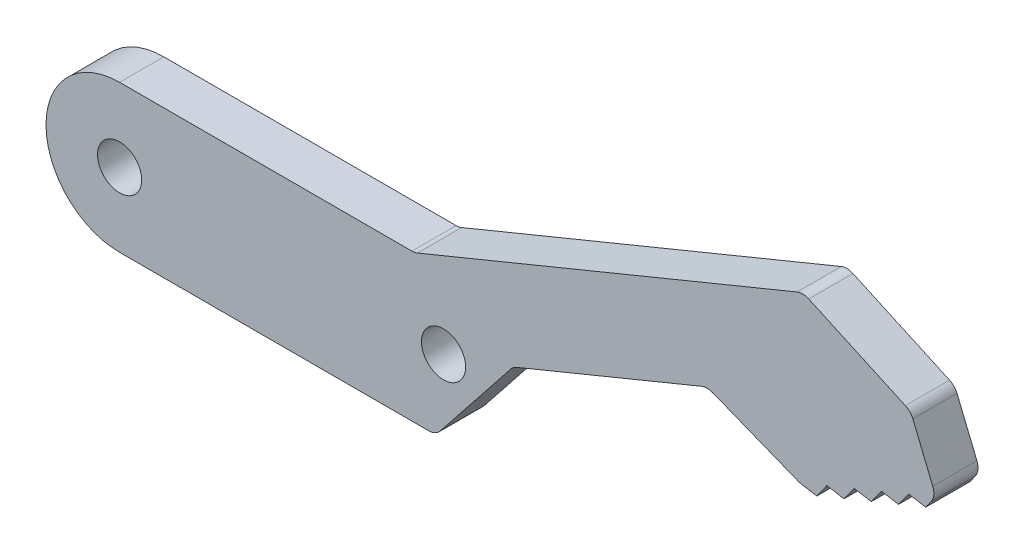
ISO-10303-21;
HEADER;
FILE_DESCRIPTION(('STEP AP214'),'2;1');
FILE_NAME('part.step','',(''),(''),'','','');
FILE_SCHEMA(('AUTOMOTIVE_DESIGN { 1 0 10303 214 1 1 1 1 }'));
ENDSEC;
DATA;
#1=APPLICATION_CONTEXT('core data for automotive mechanical design processes');
#2=APPLICATION_PROTOCOL_DEFINITION('international standard','automotive_design',2000,#1);
#3=PRODUCT_CONTEXT('',#1,'mechanical');
#4=PRODUCT('Part','Part','',(#3));
#5=PRODUCT_RELATED_PRODUCT_CATEGORY('part','',(#4));
#6=PRODUCT_DEFINITION_FORMATION('','',#4);
#7=PRODUCT_DEFINITION_CONTEXT('part definition',#1,'design');
#8=PRODUCT_DEFINITION('design','',#6,#7);
#9=PRODUCT_DEFINITION_SHAPE('','',#8);
#10=(LENGTH_UNIT() NAMED_UNIT(*) SI_UNIT(.MILLI.,.METRE.));
#11=(NAMED_UNIT(*) PLANE_ANGLE_UNIT() SI_UNIT($,.RADIAN.));
#12=(NAMED_UNIT(*) SI_UNIT($,.STERADIAN.) SOLID_ANGLE_UNIT());
#13=UNCERTAINTY_MEASURE_WITH_UNIT(LENGTH_MEASURE(1.E-05),#10,'distance_accuracy_value','');
#14=(GEOMETRIC_REPRESENTATION_CONTEXT(3) GLOBAL_UNCERTAINTY_ASSIGNED_CONTEXT((#13)) GLOBAL_UNIT_ASSIGNED_CONTEXT((#10,
#11,#12)) REPRESENTATION_CONTEXT('',''));
#15=CARTESIAN_POINT('',(0.,0.,0.));
#16=DIRECTION('',(0.,0.,1.));
#17=DIRECTION('',(1.,0.,0.));
#18=AXIS2_PLACEMENT_3D('',#15,#16,#17);
#19=CARTESIAN_POINT('',(15.6100011693867,-12.3893831285767,3.));
#20=DIRECTION('',(0.783276849572269,-0.621673046644408,0.));
#21=DIRECTION('',(0.621673046644408,0.783276849572269,0.));
#22=AXIS2_PLACEMENT_3D('',#19,#20,#21);
#23=PLANE('',#22);
#24=DIRECTION('',(-0.621673046644408,-0.783276849572269,0.));
#25=VECTOR('',#24,1.);
#26=CARTESIAN_POINT('',(15.6100011693867,-12.3893831285767,3.));
#27=LINE('',#26,#25);
#28=CARTESIAN_POINT('',(26.5678975894958,1.41701660551342,3.));
#29=VERTEX_POINT('',#28);
#30=CARTESIAN_POINT('',(21.7750959180982,-4.62167304664441,3.));
#31=VERTEX_POINT('',#30);
#32=EDGE_CURVE('E376',#29,#31,#27,.T.);
#33=ORIENTED_EDGE('',*,*,#32,.T.);
#34=DIRECTION('',(0.,0.,-1.));
#35=VECTOR('',#34,1.);
#36=CARTESIAN_POINT('',(21.7750959180982,-4.62167304664441,0.));
#37=LINE('',#36,#35);
#38=CARTESIAN_POINT('',(21.7750959180982,-4.62167304664441,0.));
#39=VERTEX_POINT('',#38);
#40=EDGE_CURVE('E336',#31,#39,#37,.T.);
#41=ORIENTED_EDGE('',*,*,#40,.T.);
#42=DIRECTION('',(-0.621673046644408,-0.783276849572269,0.));
#43=VECTOR('',#42,1.);
#44=CARTESIAN_POINT('',(15.6100011693867,-12.3893831285767,0.));
#45=LINE('',#44,#43);
#46=CARTESIAN_POINT('',(26.5678975894958,1.41701660551342,0.));
#47=VERTEX_POINT('',#46);
#48=EDGE_CURVE('E358',#47,#39,#45,.T.);
#49=ORIENTED_EDGE('',*,*,#48,.F.);
#50=DIRECTION('',(0.,0.,-1.));
#51=VECTOR('',#50,1.);
#52=CARTESIAN_POINT('',(26.5678975894958,1.41701660551342,3.));
#53=LINE('',#52,#51);
#54=EDGE_CURVE('E333',#47,#29,#53,.F.);
#55=ORIENTED_EDGE('',*,*,#54,.T.);
#56=EDGE_LOOP('',(#33,#41,#49,#55));
#57=FACE_BOUND('',#56,.T.);
#58=ADVANCED_FACE('F41',(#57),#23,.T.);
#59=CARTESIAN_POINT('',(3.2950033831404,-8.01412070884608,3.));
#60=DIRECTION('',(0.380263412733207,-0.924878228166549,0.));
#61=DIRECTION('',(0.924878228166549,0.380263412733207,0.));
#62=AXIS2_PLACEMENT_3D('',#59,#60,#61);
#63=PLANE('',#62);
#64=DIRECTION('',(-0.924878228166549,-0.380263412733207,0.));
#65=VECTOR('',#64,1.);
#66=CARTESIAN_POINT('',(3.2950033831404,-8.01412070884608,0.));
#67=LINE('',#66,#65);
#68=CARTESIAN_POINT('',(39.5264893293259,6.88244413040183,0.));
#69=VERTEX_POINT('',#68);
#70=CARTESIAN_POINT('',(26.9709110263349,1.72022178703556,0.));
#71=VERTEX_POINT('',#70);
#72=EDGE_CURVE('E360',#69,#71,#67,.T.);
#73=ORIENTED_EDGE('',*,*,#72,.F.);
#74=DIRECTION('',(0.,0.,-1.));
#75=VECTOR('',#74,1.);
#76=CARTESIAN_POINT('',(39.5264893293259,6.88244413040183,3.));
#77=LINE('',#76,#75);
#78=CARTESIAN_POINT('',(39.5264893293259,6.88244413040183,3.));
#79=VERTEX_POINT('',#78);
#80=EDGE_CURVE('E330',#69,#79,#77,.F.);
#81=ORIENTED_EDGE('',*,*,#80,.T.);
#82=DIRECTION('',(-0.924878228166549,-0.380263412733207,0.));
#83=VECTOR('',#82,1.);
#84=CARTESIAN_POINT('',(3.2950033831404,-8.01412070884608,3.));
#85=LINE('',#84,#83);
#86=CARTESIAN_POINT('',(26.9709110263349,1.72022178703556,3.));
#87=VERTEX_POINT('',#86);
#88=EDGE_CURVE('E374',#79,#87,#85,.T.);
#89=ORIENTED_EDGE('',*,*,#88,.T.);
#90=DIRECTION('',(0.,0.,-1.));
#91=VECTOR('',#90,1.);
#92=CARTESIAN_POINT('',(26.9709110263349,1.72022178703556,0.));
#93=LINE('',#92,#91);
#94=EDGE_CURVE('E326',#87,#71,#93,.T.);
#95=ORIENTED_EDGE('',*,*,#94,.T.);
#96=EDGE_LOOP('',(#73,#81,#89,#95));
#97=FACE_BOUND('',#96,.T.);
#98=ADVANCED_FACE('F378',(#97),#63,.T.);
#99=CARTESIAN_POINT('',(7.84369243763637,19.7605066346556,3.));
#100=DIRECTION('',(-0.368935795459582,-0.929454882621317,0.));
#101=DIRECTION('',(0.929454882621317,-0.368935795459582,0.));
#102=AXIS2_PLACEMENT_3D('',#99,#100,#101);
#103=PLANE('',#102);
#104=DIRECTION('',(-0.929454882621317,0.368935795459582,0.));
#105=VECTOR('',#104,1.);
#106=CARTESIAN_POINT('',(7.84369243763637,19.7605066346556,0.));
#107=LINE('',#106,#105);
#108=CARTESIAN_POINT('',(46.0908425261848,4.57876623410547,0.));
#109=VERTEX_POINT('',#108);
#110=CARTESIAN_POINT('',(40.2756885375187,6.8870207848566,0.));
#111=VERTEX_POINT('',#110);
#112=EDGE_CURVE('E452',#109,#111,#107,.T.);
#113=ORIENTED_EDGE('',*,*,#112,.F.);
#114=DIRECTION('',(0.,0.,-1.));
#115=VECTOR('',#114,1.);
#116=CARTESIAN_POINT('',(46.0908425261848,4.57876623410548,3.));
#117=LINE('',#116,#115);
#118=CARTESIAN_POINT('',(46.0908425261848,4.57876623410547,3.));
#119=VERTEX_POINT('',#118);
#120=EDGE_CURVE('E281',#109,#119,#117,.F.);
#121=ORIENTED_EDGE('',*,*,#120,.T.);
#122=DIRECTION('',(-0.929454882621317,0.368935795459582,0.));
#123=VECTOR('',#122,1.);
#124=CARTESIAN_POINT('',(7.84369243763637,19.7605066346556,3.));
#125=LINE('',#124,#123);
#126=CARTESIAN_POINT('',(40.2756885375187,6.8870207848566,3.));
#127=VERTEX_POINT('',#126);
#128=EDGE_CURVE('E236',#119,#127,#125,.T.);
#129=ORIENTED_EDGE('',*,*,#128,.T.);
#130=DIRECTION('',(0.,0.,-1.));
#131=VECTOR('',#130,1.);
#132=CARTESIAN_POINT('',(40.2756885375187,6.8870207848566,0.));
#133=LINE('',#132,#131);
#134=EDGE_CURVE('E277',#127,#111,#133,.T.);
#135=ORIENTED_EDGE('',*,*,#134,.T.);
#136=EDGE_LOOP('',(#113,#121,#129,#135));
#137=FACE_BOUND('',#136,.T.);
#138=ADVANCED_FACE('F632',(#137),#103,.T.);
#139=CARTESIAN_POINT('',(2.04998063607044,12.0493696274543,3.));
#140=DIRECTION('',(0.167721751487348,0.985834374567055,0.));
#141=DIRECTION('',(-0.985834374567055,0.167721751487348,0.));
#142=AXIS2_PLACEMENT_3D('',#139,#140,#141);
#143=PLANE('',#142);
#144=DIRECTION('',(0.985834374567055,-0.167721751487348,0.));
#145=VECTOR('',#144,1.);
#146=CARTESIAN_POINT('',(2.04998063607044,12.0493696274543,3.));
#147=LINE('',#146,#145);
#148=CARTESIAN_POINT('',(46.2920565701571,4.52238674215974,3.));
#149=VERTEX_POINT('',#148);
#150=CARTESIAN_POINT('',(47.3510308865051,4.3422215625919,3.));
#151=VERTEX_POINT('',#150);
#152=EDGE_CURVE('E222',#149,#151,#147,.T.);
#153=ORIENTED_EDGE('',*,*,#152,.F.);
#154=DIRECTION('',(0.,0.,-1.));
#155=VECTOR('',#154,1.);
#156=CARTESIAN_POINT('',(46.2920565701571,4.52238674215974,0.));
#157=LINE('',#156,#155);
#158=CARTESIAN_POINT('',(46.2920565701571,4.52238674215974,0.));
#159=VERTEX_POINT('',#158);
#160=EDGE_CURVE('E253',#149,#159,#157,.T.);
#161=ORIENTED_EDGE('',*,*,#160,.T.);
#162=DIRECTION('',(0.985834374567055,-0.167721751487348,0.));
#163=VECTOR('',#162,1.);
#164=CARTESIAN_POINT('',(2.04998063607044,12.0493696274543,0.));
#165=LINE('',#164,#163);
#166=CARTESIAN_POINT('',(47.3510308865051,4.3422215625919,0.));
#167=VERTEX_POINT('',#166);
#168=EDGE_CURVE('E250',#159,#167,#165,.T.);
#169=ORIENTED_EDGE('',*,*,#168,.T.);
#170=DIRECTION('',(0.,0.,-1.));
#171=VECTOR('',#170,1.);
#172=CARTESIAN_POINT('',(47.3510308865051,4.3422215625919,3.));
#173=LINE('',#172,#171);
#174=EDGE_CURVE('E242',#151,#167,#173,.T.);
#175=ORIENTED_EDGE('',*,*,#174,.F.);
#176=EDGE_LOOP('',(#153,#161,#169,#175));
#177=FACE_BOUND('',#176,.T.);
#178=ADVANCED_FACE('F248',(#177),#143,.F.);
#179=CARTESIAN_POINT('',(29.2140395089279,-20.9496267653803,3.));
#180=DIRECTION('',(-0.812647209633235,0.582755963225875,0.));
#181=DIRECTION('',(-0.582755963225875,-0.812647209633235,0.));
#182=AXIS2_PLACEMENT_3D('',#179,#180,#181);
#183=PLANE('',#182);
#184=DIRECTION('',(0.582755963225875,0.812647209633235,0.));
#185=VECTOR('',#184,1.);
#186=CARTESIAN_POINT('',(29.2140395089279,-20.9496267653803,0.));
#187=LINE('',#186,#185);
#188=CARTESIAN_POINT('',(48.0382444817134,5.30053386792919,0.));
#189=VERTEX_POINT('',#188);
#190=EDGE_CURVE('E458',#167,#189,#187,.T.);
#191=ORIENTED_EDGE('',*,*,#190,.T.);
#192=DIRECTION('',(0.,0.,-1.));
#193=VECTOR('',#192,1.);
#194=CARTESIAN_POINT('',(48.0382444817134,5.30053386792919,3.));
#195=LINE('',#194,#193);
#196=CARTESIAN_POINT('',(48.0382444817134,5.30053386792919,3.));
#197=VERTEX_POINT('',#196);
#198=EDGE_CURVE('E244',#197,#189,#195,.T.);
#199=ORIENTED_EDGE('',*,*,#198,.F.);
#200=DIRECTION('',(0.582755963225875,0.812647209633235,0.));
#201=VECTOR('',#200,1.);
#202=CARTESIAN_POINT('',(29.2140395089279,-20.9496267653803,3.));
#203=LINE('',#202,#201);
#204=EDGE_CURVE('E227',#151,#197,#203,.T.);
#205=ORIENTED_EDGE('',*,*,#204,.F.);
#206=ORIENTED_EDGE('',*,*,#174,.T.);
#207=EDGE_LOOP('',(#191,#199,#205,#206));
#208=FACE_BOUND('',#207,.T.);
#209=ADVANCED_FACE('F241',(#208),#183,.F.);
#210=CARTESIAN_POINT('',(2.22776533707788,13.0943519745325,3.));
#211=DIRECTION('',(0.167721751487343,0.985834374567056,0.));
#212=DIRECTION('',(-0.985834374567056,0.167721751487343,0.));
#213=AXIS2_PLACEMENT_3D('',#210,#211,#212);
#214=PLANE('',#213);
#215=DIRECTION('',(0.985834374567056,-0.167721751487343,0.));
#216=VECTOR('',#215,1.);
#217=CARTESIAN_POINT('',(2.22776533707788,13.0943519745325,0.));
#218=LINE('',#217,#216);
#219=CARTESIAN_POINT('',(49.2007873428383,5.10274838805832,0.));
#220=VERTEX_POINT('',#219);
#221=EDGE_CURVE('E461',#189,#220,#218,.T.);
#222=ORIENTED_EDGE('',*,*,#221,.T.);
#223=DIRECTION('',(0.,0.,-1.));
#224=VECTOR('',#223,1.);
#225=CARTESIAN_POINT('',(49.2007873428383,5.10274838805832,3.));
#226=LINE('',#225,#224);
#227=CARTESIAN_POINT('',(49.2007873428383,5.10274838805832,3.));
#228=VERTEX_POINT('',#227);
#229=EDGE_CURVE('E259',#228,#220,#226,.T.);
#230=ORIENTED_EDGE('',*,*,#229,.F.);
#231=DIRECTION('',(0.985834374567056,-0.167721751487343,0.));
#232=VECTOR('',#231,1.);
#233=CARTESIAN_POINT('',(2.22776533707788,13.0943519745325,3.));
#234=LINE('',#233,#232);
#235=EDGE_CURVE('E246',#197,#228,#234,.T.);
#236=ORIENTED_EDGE('',*,*,#235,.F.);
#237=ORIENTED_EDGE('',*,*,#198,.T.);
#238=EDGE_LOOP('',(#222,#230,#236,#237));
#239=FACE_BOUND('',#238,.T.);
#240=ADVANCED_FACE('F553',(#239),#214,.F.);
#241=CARTESIAN_POINT('',(30.0754438283324,-21.5673468509608,3.));
#242=DIRECTION('',(-0.812647209633238,0.582755963225871,0.));
#243=DIRECTION('',(-0.582755963225871,-0.812647209633238,0.));
#244=AXIS2_PLACEMENT_3D('',#241,#242,#243);
#245=PLANE('',#244);
#246=DIRECTION('',(0.582755963225871,0.812647209633238,0.));
#247=VECTOR('',#246,1.);
#248=CARTESIAN_POINT('',(30.0754438283324,-21.5673468509608,0.));
#249=LINE('',#248,#247);
#250=CARTESIAN_POINT('',(49.8880009380465,6.06106069339562,0.));
#251=VERTEX_POINT('',#250);
#252=EDGE_CURVE('E465',#220,#251,#249,.T.);
#253=ORIENTED_EDGE('',*,*,#252,.T.);
#254=DIRECTION('',(0.,0.,-1.));
#255=VECTOR('',#254,1.);
#256=CARTESIAN_POINT('',(49.8880009380465,6.06106069339562,3.));
#257=LINE('',#256,#255);
#258=CARTESIAN_POINT('',(49.8880009380465,6.06106069339562,3.));
#259=VERTEX_POINT('',#258);
#260=EDGE_CURVE('E543',#259,#251,#257,.T.);
#261=ORIENTED_EDGE('',*,*,#260,.F.);
#262=DIRECTION('',(0.582755963225871,0.812647209633238,0.));
#263=VECTOR('',#262,1.);
#264=CARTESIAN_POINT('',(30.0754438283324,-21.5673468509608,3.));
#265=LINE('',#264,#263);
#266=EDGE_CURVE('E392',#228,#259,#265,.T.);
#267=ORIENTED_EDGE('',*,*,#266,.F.);
#268=ORIENTED_EDGE('',*,*,#229,.T.);
#269=EDGE_LOOP('',(#253,#261,#267,#268));
#270=FACE_BOUND('',#269,.T.);
#271=ADVANCED_FACE('F550',(#270),#245,.F.);
#272=CARTESIAN_POINT('',(2.40555003808533,14.1393343216108,3.));
#273=DIRECTION('',(0.167721751487339,0.985834374567056,0.));
#274=DIRECTION('',(-0.985834374567057,0.167721751487339,0.));
#275=AXIS2_PLACEMENT_3D('',#272,#273,#274);
#276=PLANE('',#275);
#277=DIRECTION('',(0.985834374567056,-0.167721751487339,0.));
#278=VECTOR('',#277,1.);
#279=CARTESIAN_POINT('',(2.40555003808533,14.1393343216108,0.));
#280=LINE('',#279,#278);
#281=CARTESIAN_POINT('',(51.0505437991714,5.86327521352474,0.));
#282=VERTEX_POINT('',#281);
#283=EDGE_CURVE('E469',#251,#282,#280,.T.);
#284=ORIENTED_EDGE('',*,*,#283,.T.);
#285=DIRECTION('',(0.,0.,-1.));
#286=VECTOR('',#285,1.);
#287=CARTESIAN_POINT('',(51.0505437991714,5.86327521352474,3.));
#288=LINE('',#287,#286);
#289=CARTESIAN_POINT('',(51.0505437991714,5.86327521352474,3.));
#290=VERTEX_POINT('',#289);
#291=EDGE_CURVE('E539',#290,#282,#288,.T.);
#292=ORIENTED_EDGE('',*,*,#291,.F.);
#293=DIRECTION('',(0.985834374567056,-0.167721751487339,0.));
#294=VECTOR('',#293,1.);
#295=CARTESIAN_POINT('',(2.40555003808533,14.1393343216108,3.));
#296=LINE('',#295,#294);
#297=EDGE_CURVE('E396',#259,#290,#296,.T.);
#298=ORIENTED_EDGE('',*,*,#297,.F.);
#299=ORIENTED_EDGE('',*,*,#260,.T.);
#300=EDGE_LOOP('',(#284,#292,#298,#299));
#301=FACE_BOUND('',#300,.T.);
#302=ADVANCED_FACE('F556',(#301),#276,.F.);
#303=CARTESIAN_POINT('',(30.9368481477369,-22.1850669365412,3.));
#304=DIRECTION('',(-0.812647209633239,0.582755963225869,0.));
#305=DIRECTION('',(-0.582755963225869,-0.812647209633239,0.));
#306=AXIS2_PLACEMENT_3D('',#303,#304,#305);
#307=PLANE('',#306);
#308=DIRECTION('',(0.582755963225869,0.812647209633239,0.));
#309=VECTOR('',#308,1.);
#310=CARTESIAN_POINT('',(30.9368481477369,-22.1850669365412,0.));
#311=LINE('',#310,#309);
#312=CARTESIAN_POINT('',(51.7377573943796,6.82158751886201,0.));
#313=VERTEX_POINT('',#312);
#314=EDGE_CURVE('E473',#282,#313,#311,.T.);
#315=ORIENTED_EDGE('',*,*,#314,.T.);
#316=DIRECTION('',(0.,0.,-1.));
#317=VECTOR('',#316,1.);
#318=CARTESIAN_POINT('',(51.7377573943796,6.82158751886201,3.));
#319=LINE('',#318,#317);
#320=CARTESIAN_POINT('',(51.7377573943796,6.82158751886201,3.));
#321=VERTEX_POINT('',#320);
#322=EDGE_CURVE('E535',#321,#313,#319,.T.);
#323=ORIENTED_EDGE('',*,*,#322,.F.);
#324=DIRECTION('',(0.582755963225869,0.812647209633239,0.));
#325=VECTOR('',#324,1.);
#326=CARTESIAN_POINT('',(30.9368481477369,-22.1850669365412,3.));
#327=LINE('',#326,#325);
#328=EDGE_CURVE('E400',#290,#321,#327,.T.);
#329=ORIENTED_EDGE('',*,*,#328,.F.);
#330=ORIENTED_EDGE('',*,*,#291,.T.);
#331=EDGE_LOOP('',(#315,#323,#329,#330));
#332=FACE_BOUND('',#331,.T.);
#333=ADVANCED_FACE('F560',(#332),#307,.F.);
#334=CARTESIAN_POINT('',(2.58333473909306,15.1843166686897,3.));
#335=DIRECTION('',(0.167721751487347,0.985834374567055,0.));
#336=DIRECTION('',(-0.985834374567055,0.167721751487347,0.));
#337=AXIS2_PLACEMENT_3D('',#334,#335,#336);
#338=PLANE('',#337);
#339=DIRECTION('',(0.985834374567055,-0.167721751487347,0.));
#340=VECTOR('',#339,1.);
#341=CARTESIAN_POINT('',(2.58333473909306,15.1843166686897,0.));
#342=LINE('',#341,#340);
#343=CARTESIAN_POINT('',(52.9003002555044,6.62380203899114,0.));
#344=VERTEX_POINT('',#343);
#345=EDGE_CURVE('E477',#313,#344,#342,.T.);
#346=ORIENTED_EDGE('',*,*,#345,.T.);
#347=DIRECTION('',(0.,0.,-1.));
#348=VECTOR('',#347,1.);
#349=CARTESIAN_POINT('',(52.9003002555044,6.62380203899114,3.));
#350=LINE('',#349,#348);
#351=CARTESIAN_POINT('',(52.9003002555044,6.62380203899114,3.));
#352=VERTEX_POINT('',#351);
#353=EDGE_CURVE('E531',#352,#344,#350,.T.);
#354=ORIENTED_EDGE('',*,*,#353,.F.);
#355=DIRECTION('',(0.985834374567055,-0.167721751487347,0.));
#356=VECTOR('',#355,1.);
#357=CARTESIAN_POINT('',(2.58333473909306,15.1843166686897,3.));
#358=LINE('',#357,#356);
#359=EDGE_CURVE('E404',#321,#352,#358,.T.);
#360=ORIENTED_EDGE('',*,*,#359,.F.);
#361=ORIENTED_EDGE('',*,*,#322,.T.);
#362=EDGE_LOOP('',(#346,#354,#360,#361));
#363=FACE_BOUND('',#362,.T.);
#364=ADVANCED_FACE('F562',(#363),#338,.F.);
#365=CARTESIAN_POINT('',(31.7982524671409,-22.8027870221218,3.));
#366=DIRECTION('',(-0.812647209633235,0.582755963225875,0.));
#367=DIRECTION('',(-0.582755963225875,-0.812647209633235,0.));
#368=AXIS2_PLACEMENT_3D('',#365,#366,#367);
#369=PLANE('',#368);
#370=DIRECTION('',(0.582755963225875,0.812647209633235,0.));
#371=VECTOR('',#370,1.);
#372=CARTESIAN_POINT('',(31.7982524671409,-22.8027870221218,0.));
#373=LINE('',#372,#371);
#374=CARTESIAN_POINT('',(53.5875138507127,7.58211434432844,0.));
#375=VERTEX_POINT('',#374);
#376=EDGE_CURVE('E481',#344,#375,#373,.T.);
#377=ORIENTED_EDGE('',*,*,#376,.T.);
#378=DIRECTION('',(0.,0.,-1.));
#379=VECTOR('',#378,1.);
#380=CARTESIAN_POINT('',(53.5875138507127,7.58211434432844,3.));
#381=LINE('',#380,#379);
#382=CARTESIAN_POINT('',(53.5875138507127,7.58211434432844,3.));
#383=VERTEX_POINT('',#382);
#384=EDGE_CURVE('E527',#383,#375,#381,.T.);
#385=ORIENTED_EDGE('',*,*,#384,.F.);
#386=DIRECTION('',(0.582755963225875,0.812647209633235,0.));
#387=VECTOR('',#386,1.);
#388=CARTESIAN_POINT('',(31.7982524671409,-22.8027870221218,3.));
#389=LINE('',#388,#387);
#390=EDGE_CURVE('E408',#352,#383,#389,.T.);
#391=ORIENTED_EDGE('',*,*,#390,.F.);
#392=ORIENTED_EDGE('',*,*,#353,.T.);
#393=EDGE_LOOP('',(#377,#385,#391,#392));
#394=FACE_BOUND('',#393,.T.);
#395=ADVANCED_FACE('F564',(#394),#369,.F.);
#396=CARTESIAN_POINT('',(2.76111944010049,16.2292990157679,3.));
#397=DIRECTION('',(0.167721751487343,0.985834374567056,0.));
#398=DIRECTION('',(-0.985834374567056,0.167721751487343,0.));
#399=AXIS2_PLACEMENT_3D('',#396,#397,#398);
#400=PLANE('',#399);
#401=DIRECTION('',(0.985834374567056,-0.167721751487343,0.));
#402=VECTOR('',#401,1.);
#403=CARTESIAN_POINT('',(2.76111944010049,16.2292990157679,0.));
#404=LINE('',#403,#402);
#405=CARTESIAN_POINT('',(54.7500567118375,7.38432886445756,0.));
#406=VERTEX_POINT('',#405);
#407=EDGE_CURVE('E485',#375,#406,#404,.T.);
#408=ORIENTED_EDGE('',*,*,#407,.T.);
#409=DIRECTION('',(0.,0.,-1.));
#410=VECTOR('',#409,1.);
#411=CARTESIAN_POINT('',(54.7500567118375,7.38432886445756,3.));
#412=LINE('',#411,#410);
#413=CARTESIAN_POINT('',(54.7500567118375,7.38432886445756,3.));
#414=VERTEX_POINT('',#413);
#415=EDGE_CURVE('E523',#414,#406,#412,.T.);
#416=ORIENTED_EDGE('',*,*,#415,.F.);
#417=DIRECTION('',(0.985834374567056,-0.167721751487343,0.));
#418=VECTOR('',#417,1.);
#419=CARTESIAN_POINT('',(2.76111944010049,16.2292990157679,3.));
#420=LINE('',#419,#418);
#421=EDGE_CURVE('E412',#383,#414,#420,.T.);
#422=ORIENTED_EDGE('',*,*,#421,.F.);
#423=ORIENTED_EDGE('',*,*,#384,.T.);
#424=EDGE_LOOP('',(#408,#416,#422,#423));
#425=FACE_BOUND('',#424,.T.);
#426=ADVANCED_FACE('F569',(#425),#400,.F.);
#427=CARTESIAN_POINT('',(32.659656786545,-23.4205071077023,3.));
#428=DIRECTION('',(-0.812647209633233,0.582755963225878,0.));
#429=DIRECTION('',(-0.582755963225878,-0.812647209633233,0.));
#430=AXIS2_PLACEMENT_3D('',#427,#428,#429);
#431=PLANE('',#430);
#432=DIRECTION('',(0.582755963225878,0.812647209633233,0.));
#433=VECTOR('',#432,1.);
#434=CARTESIAN_POINT('',(32.659656786545,-23.4205071077023,0.));
#435=LINE('',#434,#433);
#436=CARTESIAN_POINT('',(55.1142791888537,7.89223337047833,0.));
#437=VERTEX_POINT('',#436);
#438=EDGE_CURVE('E489',#406,#437,#435,.T.);
#439=ORIENTED_EDGE('',*,*,#438,.T.);
#440=DIRECTION('',(0.,0.,-1.));
#441=VECTOR('',#440,1.);
#442=CARTESIAN_POINT('',(55.1142791888537,7.89223337047833,3.));
#443=LINE('',#442,#441);
#444=CARTESIAN_POINT('',(55.1142791888537,7.89223337047833,3.));
#445=VERTEX_POINT('',#444);
#446=EDGE_CURVE('E305',#437,#445,#443,.F.);
#447=ORIENTED_EDGE('',*,*,#446,.T.);
#448=DIRECTION('',(0.582755963225878,0.812647209633233,0.));
#449=VECTOR('',#448,1.);
#450=CARTESIAN_POINT('',(32.659656786545,-23.4205071077023,3.));
#451=LINE('',#450,#449);
#452=EDGE_CURVE('E416',#414,#445,#451,.T.);
#453=ORIENTED_EDGE('',*,*,#452,.F.);
#454=ORIENTED_EDGE('',*,*,#415,.T.);
#455=EDGE_LOOP('',(#439,#447,#453,#454));
#456=FACE_BOUND('',#455,.T.);
#457=ADVANCED_FACE('F571',(#456),#431,.F.);
#458=CARTESIAN_POINT('',(50.3551112402656,20.7034892439219,3.));
#459=DIRECTION('',(0.924878228166549,0.380263412733207,0.));
#460=DIRECTION('',(-0.380263412733207,0.924878228166549,0.));
#461=AXIS2_PLACEMENT_3D('',#458,#459,#460);
#462=PLANE('',#461);
#463=DIRECTION('',(0.380263412733207,-0.924878228166549,0.));
#464=VECTOR('',#463,1.);
#465=CARTESIAN_POINT('',(50.3551112402656,20.7034892439219,3.));
#466=LINE('',#465,#464);
#467=CARTESIAN_POINT('',(53.8764912996726,12.138774256918,3.));
#468=VERTEX_POINT('',#467);
#469=CARTESIAN_POINT('',(55.226510207387,8.85525274643742,3.));
#470=VERTEX_POINT('',#469);
#471=EDGE_CURVE('E420',#468,#470,#466,.T.);
#472=ORIENTED_EDGE('',*,*,#471,.T.);
#473=DIRECTION('',(0.,0.,-1.));
#474=VECTOR('',#473,1.);
#475=CARTESIAN_POINT('',(55.226510207387,8.85525274643742,0.));
#476=LINE('',#475,#474);
#477=CARTESIAN_POINT('',(55.226510207387,8.85525274643742,0.));
#478=VERTEX_POINT('',#477);
#479=EDGE_CURVE('E301',#470,#478,#476,.T.);
#480=ORIENTED_EDGE('',*,*,#479,.T.);
#481=DIRECTION('',(0.380263412733207,-0.924878228166549,0.));
#482=VECTOR('',#481,1.);
#483=CARTESIAN_POINT('',(50.3551112402656,20.7034892439219,0.));
#484=LINE('',#483,#482);
#485=CARTESIAN_POINT('',(53.8764912996726,12.138774256918,0.));
#486=VERTEX_POINT('',#485);
#487=EDGE_CURVE('E493',#486,#478,#484,.T.);
#488=ORIENTED_EDGE('',*,*,#487,.F.);
#489=DIRECTION('',(0.,0.,-1.));
#490=VECTOR('',#489,1.);
#491=CARTESIAN_POINT('',(53.8764912996726,12.138774256918,3.));
#492=LINE('',#491,#490);
#493=EDGE_CURVE('E298',#486,#468,#492,.F.);
#494=ORIENTED_EDGE('',*,*,#493,.T.);
#495=EDGE_LOOP('',(#472,#480,#488,#494));
#496=FACE_BOUND('',#495,.T.);
#497=ADVANCED_FACE('F579',(#496),#462,.T.);
#498=CARTESIAN_POINT('',(13.9488099268583,30.6231164748253,3.));
#499=DIRECTION('',(0.414522259932086,0.910039172794664,0.));
#500=DIRECTION('',(-0.910039172794664,0.414522259932086,0.));
#501=AXIS2_PLACEMENT_3D('',#498,#499,#500);
#502=PLANE('',#501);
#503=DIRECTION('',(0.910039172794664,-0.414522259932086,0.));
#504=VECTOR('',#503,1.);
#505=CARTESIAN_POINT('',(13.9488099268583,30.6231164748253,3.));
#506=LINE('',#505,#504);
#507=CARTESIAN_POINT('',(46.8032086062433,15.6579589338968,3.));
#508=VERTEX_POINT('',#507);
#509=CARTESIAN_POINT('',(53.3661353314382,12.6685500169795,3.));
#510=VERTEX_POINT('',#509);
#511=EDGE_CURVE('E424',#508,#510,#506,.T.);
#512=ORIENTED_EDGE('',*,*,#511,.T.);
#513=DIRECTION('',(0.,0.,-1.));
#514=VECTOR('',#513,1.);
#515=CARTESIAN_POINT('',(53.3661353314382,12.6685500169795,3.));
#516=LINE('',#515,#514);
#517=CARTESIAN_POINT('',(53.3661353314382,12.6685500169795,0.));
#518=VERTEX_POINT('',#517);
#519=EDGE_CURVE('E311',#510,#518,#516,.T.);
#520=ORIENTED_EDGE('',*,*,#519,.T.);
#521=DIRECTION('',(0.910039172794664,-0.414522259932086,0.));
#522=VECTOR('',#521,1.);
#523=CARTESIAN_POINT('',(13.9488099268583,30.6231164748253,0.));
#524=LINE('',#523,#522);
#525=CARTESIAN_POINT('',(46.8032086062433,15.6579589338968,0.));
#526=VERTEX_POINT('',#525);
#527=EDGE_CURVE('E497',#526,#518,#524,.T.);
#528=ORIENTED_EDGE('',*,*,#527,.F.);
#529=DIRECTION('',(0.,0.,-1.));
#530=VECTOR('',#529,1.);
#531=CARTESIAN_POINT('',(46.8032086062433,15.6579589338968,3.));
#532=LINE('',#531,#530);
#533=EDGE_CURVE('E308',#526,#508,#532,.F.);
#534=ORIENTED_EDGE('',*,*,#533,.T.);
#535=EDGE_LOOP('',(#512,#520,#528,#534));
#536=FACE_BOUND('',#535,.T.);
#537=ADVANCED_FACE('F588',(#536),#502,.T.);
#538=CARTESIAN_POINT('',(1.14074851739701,-2.77453321099285,3.));
#539=DIRECTION('',(-0.380263412733207,0.924878228166549,0.));
#540=DIRECTION('',(-0.924878228166549,-0.380263412733207,0.));
#541=AXIS2_PLACEMENT_3D('',#538,#539,#540);
#542=PLANE('',#541);
#543=DIRECTION('',(0.924878228166549,0.380263412733207,0.));
#544=VECTOR('',#543,1.);
#545=CARTESIAN_POINT('',(1.14074851739701,-2.77453321099285,3.));
#546=LINE('',#545,#544);
#547=CARTESIAN_POINT('',(20.2327114807882,5.07512177183345,3.));
#548=VERTEX_POINT('',#547);
#549=CARTESIAN_POINT('',(46.0084229335781,15.6727979892687,3.));
#550=VERTEX_POINT('',#549);
#551=EDGE_CURVE('E428',#548,#550,#546,.T.);
#552=ORIENTED_EDGE('',*,*,#551,.T.);
#553=DIRECTION('',(0.,0.,-1.));
#554=VECTOR('',#553,1.);
#555=CARTESIAN_POINT('',(46.008422933578,15.6727979892687,3.));
#556=LINE('',#555,#554);
#557=CARTESIAN_POINT('',(46.0084229335781,15.6727979892687,0.));
#558=VERTEX_POINT('',#557);
#559=EDGE_CURVE('E318',#550,#558,#556,.T.);
#560=ORIENTED_EDGE('',*,*,#559,.T.);
#561=DIRECTION('',(0.924878228166549,0.380263412733207,0.));
#562=VECTOR('',#561,1.);
#563=CARTESIAN_POINT('',(1.14074851739701,-2.77453321099285,0.));
#564=LINE('',#563,#562);
#565=CARTESIAN_POINT('',(20.2327114807882,5.07512177183345,0.));
#566=VERTEX_POINT('',#565);
#567=EDGE_CURVE('E501',#566,#558,#564,.T.);
#568=ORIENTED_EDGE('',*,*,#567,.F.);
#569=DIRECTION('',(0.,0.,-1.));
#570=VECTOR('',#569,1.);
#571=CARTESIAN_POINT('',(20.2327114807882,5.07512177183345,3.));
#572=LINE('',#571,#570);
#573=EDGE_CURVE('E315',#566,#548,#572,.F.);
#574=ORIENTED_EDGE('',*,*,#573,.T.);
#575=EDGE_LOOP('',(#552,#560,#568,#574));
#576=FACE_BOUND('',#575,.T.);
#577=ADVANCED_FACE('F595',(#576),#542,.T.);
#578=CARTESIAN_POINT('',(0.,5.,3.));
#579=DIRECTION('',(0.,1.,0.));
#580=DIRECTION('',(0.,0.,1.));
#581=AXIS2_PLACEMENT_3D('',#578,#579,#580);
#582=PLANE('',#581);
#583=DIRECTION('',(1.,0.,0.));
#584=VECTOR('',#583,1.);
#585=CARTESIAN_POINT('',(0.,5.,3.));
#586=LINE('',#585,#584);
#587=CARTESIAN_POINT('',(0.,5.,3.));
#588=VERTEX_POINT('',#587);
#589=CARTESIAN_POINT('',(19.852448068055,5.,3.));
#590=VERTEX_POINT('',#589);
#591=EDGE_CURVE('E432',#588,#590,#586,.T.);
#592=ORIENTED_EDGE('',*,*,#591,.T.);
#593=DIRECTION('',(0.,0.,-1.));
#594=VECTOR('',#593,1.);
#595=CARTESIAN_POINT('',(19.852448068055,5.,0.));
#596=LINE('',#595,#594);
#597=CARTESIAN_POINT('',(19.852448068055,5.,0.));
#598=VERTEX_POINT('',#597);
#599=EDGE_CURVE('E322',#590,#598,#596,.T.);
#600=ORIENTED_EDGE('',*,*,#599,.T.);
#601=DIRECTION('',(1.,0.,0.));
#602=VECTOR('',#601,1.);
#603=CARTESIAN_POINT('',(0.,5.,0.));
#604=LINE('',#603,#602);
#605=CARTESIAN_POINT('',(0.,5.,0.));
#606=VERTEX_POINT('',#605);
#607=EDGE_CURVE('E505',#606,#598,#604,.T.);
#608=ORIENTED_EDGE('',*,*,#607,.F.);
#609=DIRECTION('',(0.,0.,-1.));
#610=VECTOR('',#609,1.);
#611=CARTESIAN_POINT('',(0.,5.,3.));
#612=LINE('',#611,#610);
#613=EDGE_CURVE('E520',#588,#606,#612,.T.);
#614=ORIENTED_EDGE('',*,*,#613,.F.);
#615=EDGE_LOOP('',(#592,#600,#608,#614));
#616=FACE_BOUND('',#615,.T.);
#617=ADVANCED_FACE('F603',(#616),#582,.T.);
#618=CARTESIAN_POINT('',(0.,0.,3.));
#619=DIRECTION('',(0.,0.,-1.));
#620=DIRECTION('',(-1.,0.,0.));
#621=AXIS2_PLACEMENT_3D('',#618,#619,#620);
#622=CYLINDRICAL_SURFACE('',#621,5.);
#623=CARTESIAN_POINT('',(0.,0.,0.));
#624=DIRECTION('',(0.,0.,1.));
#625=DIRECTION('',(1.,0.,0.));
#626=AXIS2_PLACEMENT_3D('',#623,#624,#625);
#627=CIRCLE('',#626,5.);
#628=CARTESIAN_POINT('',(0.,-5.,0.));
#629=VERTEX_POINT('',#628);
#630=EDGE_CURVE('E509',#606,#629,#627,.T.);
#631=ORIENTED_EDGE('',*,*,#630,.T.);
#632=DIRECTION('',(0.,0.,-1.));
#633=VECTOR('',#632,1.);
#634=CARTESIAN_POINT('',(0.,-5.,3.));
#635=LINE('',#634,#633);
#636=CARTESIAN_POINT('',(0.,-5.,3.));
#637=VERTEX_POINT('',#636);
#638=EDGE_CURVE('E442',#637,#629,#635,.T.);
#639=ORIENTED_EDGE('',*,*,#638,.F.);
#640=CARTESIAN_POINT('',(0.,0.,3.));
#641=DIRECTION('',(0.,0.,1.));
#642=DIRECTION('',(1.,0.,0.));
#643=AXIS2_PLACEMENT_3D('',#640,#641,#642);
#644=CIRCLE('',#643,5.);
#645=EDGE_CURVE('E435',#588,#637,#644,.T.);
#646=ORIENTED_EDGE('',*,*,#645,.F.);
#647=ORIENTED_EDGE('',*,*,#613,.T.);
#648=EDGE_LOOP('',(#631,#639,#646,#647));
#649=FACE_BOUND('',#648,.T.);
#650=ADVANCED_FACE('F607',(#649),#622,.T.);
#651=CARTESIAN_POINT('',(0.,0.,3.));
#652=DIRECTION('',(0.,0.,-1.));
#653=DIRECTION('',(-1.,0.,0.));
#654=AXIS2_PLACEMENT_3D('',#651,#652,#653);
#655=CYLINDRICAL_SURFACE('',#654,1.5);
#656=CARTESIAN_POINT('',(0.,0.,3.));
#657=DIRECTION('',(0.,0.,1.));
#658=DIRECTION('',(1.,0.,0.));
#659=AXIS2_PLACEMENT_3D('',#656,#657,#658);
#660=CIRCLE('',#659,1.5);
#661=CARTESIAN_POINT('',(1.5,0.,3.));
#662=VERTEX_POINT('',#661);
#663=EDGE_CURVE('E386',#662,#662,#660,.T.);
#664=ORIENTED_EDGE('',*,*,#663,.T.);
#665=EDGE_LOOP('',(#664));
#666=FACE_BOUND('',#665,.T.);
#667=CARTESIAN_POINT('',(0.,0.,0.));
#668=DIRECTION('',(0.,0.,1.));
#669=DIRECTION('',(1.,0.,0.));
#670=AXIS2_PLACEMENT_3D('',#667,#668,#669);
#671=CIRCLE('',#670,1.5);
#672=CARTESIAN_POINT('',(1.5,0.,0.));
#673=VERTEX_POINT('',#672);
#674=EDGE_CURVE('E369',#673,#673,#671,.T.);
#675=ORIENTED_EDGE('',*,*,#674,.F.);
#676=EDGE_LOOP('',(#675));
#677=FACE_BOUND('',#676,.T.);
#678=ADVANCED_FACE('F622',(#666,#677),#655,.F.);
#679=CARTESIAN_POINT('',(22.,0.,3.));
#680=DIRECTION('',(0.,0.,-1.));
#681=DIRECTION('',(-1.,0.,0.));
#682=AXIS2_PLACEMENT_3D('',#679,#680,#681);
#683=CYLINDRICAL_SURFACE('',#682,1.5);
#684=CARTESIAN_POINT('',(22.,0.,3.));
#685=DIRECTION('',(0.,0.,1.));
#686=DIRECTION('',(1.,0.,0.));
#687=AXIS2_PLACEMENT_3D('',#684,#685,#686);
#688=CIRCLE('',#687,1.5);
#689=CARTESIAN_POINT('',(23.5,0.,3.));
#690=VERTEX_POINT('',#689);
#691=EDGE_CURVE('E516',#690,#690,#688,.T.);
#692=ORIENTED_EDGE('',*,*,#691,.T.);
#693=EDGE_LOOP('',(#692));
#694=FACE_BOUND('',#693,.T.);
#695=CARTESIAN_POINT('',(22.,0.,0.));
#696=DIRECTION('',(0.,0.,1.));
#697=DIRECTION('',(1.,0.,0.));
#698=AXIS2_PLACEMENT_3D('',#695,#696,#697);
#699=CIRCLE('',#698,1.5);
#700=CARTESIAN_POINT('',(23.5,0.,0.));
#701=VERTEX_POINT('',#700);
#702=EDGE_CURVE('E443',#701,#701,#699,.T.);
#703=ORIENTED_EDGE('',*,*,#702,.F.);
#704=EDGE_LOOP('',(#703));
#705=FACE_BOUND('',#704,.T.);
#706=ADVANCED_FACE('F614',(#694,#705),#683,.F.);
#707=CARTESIAN_POINT('',(0.,-5.,3.));
#708=DIRECTION('',(0.,1.,0.));
#709=DIRECTION('',(0.,0.,1.));
#710=AXIS2_PLACEMENT_3D('',#707,#708,#709);
#711=PLANE('',#710);
#712=DIRECTION('',(1.,0.,0.));
#713=VECTOR('',#712,1.);
#714=CARTESIAN_POINT('',(0.,-5.,0.));
#715=LINE('',#714,#713);
#716=CARTESIAN_POINT('',(20.9918190685259,-5.,0.));
#717=VERTEX_POINT('',#716);
#718=EDGE_CURVE('E513',#629,#717,#715,.T.);
#719=ORIENTED_EDGE('',*,*,#718,.T.);
#720=DIRECTION('',(0.,0.,-1.));
#721=VECTOR('',#720,1.);
#722=CARTESIAN_POINT('',(20.9918190685259,-5.,3.));
#723=LINE('',#722,#721);
#724=CARTESIAN_POINT('',(20.9918190685259,-5.,3.));
#725=VERTEX_POINT('',#724);
#726=EDGE_CURVE('E57',#717,#725,#723,.F.);
#727=ORIENTED_EDGE('',*,*,#726,.T.);
#728=DIRECTION('',(1.,0.,0.));
#729=VECTOR('',#728,1.);
#730=CARTESIAN_POINT('',(0.,-5.,3.));
#731=LINE('',#730,#729);
#732=EDGE_CURVE('E439',#637,#725,#731,.T.);
#733=ORIENTED_EDGE('',*,*,#732,.F.);
#734=ORIENTED_EDGE('',*,*,#638,.T.);
#735=EDGE_LOOP('',(#719,#727,#733,#734));
#736=FACE_BOUND('',#735,.T.);
#737=ADVANCED_FACE('F612',(#736),#711,.F.);
#738=CARTESIAN_POINT('',(0.,0.,3.));
#739=DIRECTION('',(0.,0.,1.));
#740=DIRECTION('',(1.,0.,0.));
#741=AXIS2_PLACEMENT_3D('',#738,#739,#740);
#742=PLANE('',#741);
#743=ORIENTED_EDGE('',*,*,#691,.F.);
#744=EDGE_LOOP('',(#743));
#745=FACE_BOUND('',#744,.T.);
#746=ORIENTED_EDGE('',*,*,#663,.F.);
#747=EDGE_LOOP('',(#746));
#748=FACE_BOUND('',#747,.T.);
#749=ORIENTED_EDGE('',*,*,#128,.F.);
#750=CARTESIAN_POINT('',(46.4597783216444,5.50822111672679,3.));
#751=DIRECTION('',(0.,0.,1.));
#752=DIRECTION('',(1.,0.,0.));
#753=AXIS2_PLACEMENT_3D('',#750,#751,#752);
#754=CIRCLE('',#753,1.);
#755=EDGE_CURVE('E230',#119,#149,#754,.T.);
#756=ORIENTED_EDGE('',*,*,#755,.T.);
#757=ORIENTED_EDGE('',*,*,#152,.T.);
#758=ORIENTED_EDGE('',*,*,#204,.T.);
#759=ORIENTED_EDGE('',*,*,#235,.T.);
#760=ORIENTED_EDGE('',*,*,#266,.T.);
#761=ORIENTED_EDGE('',*,*,#297,.T.);
#762=ORIENTED_EDGE('',*,*,#328,.T.);
#763=ORIENTED_EDGE('',*,*,#359,.T.);
#764=ORIENTED_EDGE('',*,*,#390,.T.);
#765=ORIENTED_EDGE('',*,*,#421,.T.);
#766=ORIENTED_EDGE('',*,*,#452,.T.);
#767=CARTESIAN_POINT('',(54.3016319792205,8.47498933370421,3.));
#768=DIRECTION('',(0.,0.,1.));
#769=DIRECTION('',(1.,0.,0.));
#770=AXIS2_PLACEMENT_3D('',#767,#768,#769);
#771=CIRCLE('',#770,1.);
#772=EDGE_CURVE('E293',#445,#470,#771,.T.);
#773=ORIENTED_EDGE('',*,*,#772,.T.);
#774=ORIENTED_EDGE('',*,*,#471,.F.);
#775=CARTESIAN_POINT('',(52.9516130715061,11.7585108441848,3.));
#776=DIRECTION('',(0.,0.,1.));
#777=DIRECTION('',(1.,0.,0.));
#778=AXIS2_PLACEMENT_3D('',#775,#776,#777);
#779=CIRCLE('',#778,1.);
#780=EDGE_CURVE('E290',#468,#510,#779,.T.);
#781=ORIENTED_EDGE('',*,*,#780,.T.);
#782=ORIENTED_EDGE('',*,*,#511,.F.);
#783=CARTESIAN_POINT('',(46.3886863463112,14.7479197611021,3.));
#784=DIRECTION('',(0.,0.,1.));
#785=DIRECTION('',(1.,0.,0.));
#786=AXIS2_PLACEMENT_3D('',#783,#784,#785);
#787=CIRCLE('',#786,1.);
#788=EDGE_CURVE('E287',#508,#550,#787,.T.);
#789=ORIENTED_EDGE('',*,*,#788,.T.);
#790=ORIENTED_EDGE('',*,*,#551,.F.);
#791=CARTESIAN_POINT('',(19.852448068055,6.,3.));
#792=DIRECTION('',(0.,0.,1.));
#793=DIRECTION('',(1.,0.,0.));
#794=AXIS2_PLACEMENT_3D('',#791,#792,#793);
#795=CIRCLE('',#794,1.);
#796=EDGE_CURVE('E65',#548,#590,#795,.F.);
#797=ORIENTED_EDGE('',*,*,#796,.T.);
#798=ORIENTED_EDGE('',*,*,#591,.F.);
#799=ORIENTED_EDGE('',*,*,#645,.T.);
#800=ORIENTED_EDGE('',*,*,#732,.T.);
#801=CARTESIAN_POINT('',(20.9918190685259,-4.,3.));
#802=DIRECTION('',(0.,0.,1.));
#803=DIRECTION('',(1.,0.,0.));
#804=AXIS2_PLACEMENT_3D('',#801,#802,#803);
#805=CIRCLE('',#804,1.);
#806=EDGE_CURVE('E284',#725,#31,#805,.T.);
#807=ORIENTED_EDGE('',*,*,#806,.T.);
#808=ORIENTED_EDGE('',*,*,#32,.F.);
#809=CARTESIAN_POINT('',(27.3511744390681,0.795343558869007,3.));
#810=DIRECTION('',(0.,0.,1.));
#811=DIRECTION('',(1.,0.,0.));
#812=AXIS2_PLACEMENT_3D('',#809,#810,#811);
#813=CIRCLE('',#812,1.);
#814=EDGE_CURVE('E11',#29,#87,#813,.F.);
#815=ORIENTED_EDGE('',*,*,#814,.T.);
#816=ORIENTED_EDGE('',*,*,#88,.F.);
#817=CARTESIAN_POINT('',(39.9067527420591,5.95756590223528,3.));
#818=DIRECTION('',(0.,0.,1.));
#819=DIRECTION('',(1.,0.,0.));
#820=AXIS2_PLACEMENT_3D('',#817,#818,#819);
#821=CIRCLE('',#820,1.);
#822=EDGE_CURVE('E350',#79,#127,#821,.F.);
#823=ORIENTED_EDGE('',*,*,#822,.T.);
#824=EDGE_LOOP('',(#749,#756,#757,#758,#759,#760,#761,#762,#763,#764,#765,#766,#773,#774,#781,
#782,#789,#790,#797,#798,#799,#800,#807,#808,#815,#816,#823));
#825=FACE_BOUND('',#824,.T.);
#826=ADVANCED_FACE('F225',(#745,#748,#825),#742,.T.);
#827=CARTESIAN_POINT('',(0.,0.,0.));
#828=DIRECTION('',(0.,0.,1.));
#829=DIRECTION('',(1.,0.,0.));
#830=AXIS2_PLACEMENT_3D('',#827,#828,#829);
#831=PLANE('',#830);
#832=ORIENTED_EDGE('',*,*,#702,.T.);
#833=EDGE_LOOP('',(#832));
#834=FACE_BOUND('',#833,.T.);
#835=ORIENTED_EDGE('',*,*,#674,.T.);
#836=EDGE_LOOP('',(#835));
#837=FACE_BOUND('',#836,.T.);
#838=ORIENTED_EDGE('',*,*,#168,.F.);
#839=CARTESIAN_POINT('',(46.4597783216444,5.50822111672679,0.));
#840=DIRECTION('',(0.,0.,1.));
#841=DIRECTION('',(1.,0.,0.));
#842=AXIS2_PLACEMENT_3D('',#839,#840,#841);
#843=CIRCLE('',#842,1.);
#844=EDGE_CURVE('E274',#159,#109,#843,.F.);
#845=ORIENTED_EDGE('',*,*,#844,.T.);
#846=ORIENTED_EDGE('',*,*,#112,.T.);
#847=CARTESIAN_POINT('',(39.9067527420591,5.95756590223528,0.));
#848=DIRECTION('',(0.,0.,1.));
#849=DIRECTION('',(1.,0.,0.));
#850=AXIS2_PLACEMENT_3D('',#847,#848,#849);
#851=CIRCLE('',#850,1.);
#852=EDGE_CURVE('E347',#111,#69,#851,.T.);
#853=ORIENTED_EDGE('',*,*,#852,.T.);
#854=ORIENTED_EDGE('',*,*,#72,.T.);
#855=CARTESIAN_POINT('',(27.3511744390681,0.795343558869007,0.));
#856=DIRECTION('',(0.,0.,1.));
#857=DIRECTION('',(1.,0.,0.));
#858=AXIS2_PLACEMENT_3D('',#855,#856,#857);
#859=CIRCLE('',#858,1.);
#860=EDGE_CURVE('E50',#71,#47,#859,.T.);
#861=ORIENTED_EDGE('',*,*,#860,.T.);
#862=ORIENTED_EDGE('',*,*,#48,.T.);
#863=CARTESIAN_POINT('',(20.9918190685259,-4.,0.));
#864=DIRECTION('',(0.,0.,1.));
#865=DIRECTION('',(1.,0.,0.));
#866=AXIS2_PLACEMENT_3D('',#863,#864,#865);
#867=CIRCLE('',#866,1.);
#868=EDGE_CURVE('E257',#39,#717,#867,.F.);
#869=ORIENTED_EDGE('',*,*,#868,.T.);
#870=ORIENTED_EDGE('',*,*,#718,.F.);
#871=ORIENTED_EDGE('',*,*,#630,.F.);
#872=ORIENTED_EDGE('',*,*,#607,.T.);
#873=CARTESIAN_POINT('',(19.852448068055,6.,0.));
#874=DIRECTION('',(0.,0.,1.));
#875=DIRECTION('',(1.,0.,0.));
#876=AXIS2_PLACEMENT_3D('',#873,#874,#875);
#877=CIRCLE('',#876,1.);
#878=EDGE_CURVE('E342',#598,#566,#877,.T.);
#879=ORIENTED_EDGE('',*,*,#878,.T.);
#880=ORIENTED_EDGE('',*,*,#567,.T.);
#881=CARTESIAN_POINT('',(46.3886863463112,14.7479197611021,0.));
#882=DIRECTION('',(0.,0.,1.));
#883=DIRECTION('',(1.,0.,0.));
#884=AXIS2_PLACEMENT_3D('',#881,#882,#883);
#885=CIRCLE('',#884,1.);
#886=EDGE_CURVE('E265',#558,#526,#885,.F.);
#887=ORIENTED_EDGE('',*,*,#886,.T.);
#888=ORIENTED_EDGE('',*,*,#527,.T.);
#889=CARTESIAN_POINT('',(52.9516130715061,11.7585108441848,0.));
#890=DIRECTION('',(0.,0.,1.));
#891=DIRECTION('',(1.,0.,0.));
#892=AXIS2_PLACEMENT_3D('',#889,#890,#891);
#893=CIRCLE('',#892,1.);
#894=EDGE_CURVE('E268',#518,#486,#893,.F.);
#895=ORIENTED_EDGE('',*,*,#894,.T.);
#896=ORIENTED_EDGE('',*,*,#487,.T.);
#897=CARTESIAN_POINT('',(54.3016319792205,8.47498933370421,0.));
#898=DIRECTION('',(0.,0.,1.));
#899=DIRECTION('',(1.,0.,0.));
#900=AXIS2_PLACEMENT_3D('',#897,#898,#899);
#901=CIRCLE('',#900,1.);
#902=EDGE_CURVE('E271',#478,#437,#901,.F.);
#903=ORIENTED_EDGE('',*,*,#902,.T.);
#904=ORIENTED_EDGE('',*,*,#438,.F.);
#905=ORIENTED_EDGE('',*,*,#407,.F.);
#906=ORIENTED_EDGE('',*,*,#376,.F.);
#907=ORIENTED_EDGE('',*,*,#345,.F.);
#908=ORIENTED_EDGE('',*,*,#314,.F.);
#909=ORIENTED_EDGE('',*,*,#283,.F.);
#910=ORIENTED_EDGE('',*,*,#252,.F.);
#911=ORIENTED_EDGE('',*,*,#221,.F.);
#912=ORIENTED_EDGE('',*,*,#190,.F.);
#913=EDGE_LOOP('',(#838,#845,#846,#853,#854,#861,#862,#869,#870,#871,#872,#879,#880,#887,#888,
#895,#896,#903,#904,#905,#906,#907,#908,#909,#910,#911,#912));
#914=FACE_BOUND('',#913,.T.);
#915=ADVANCED_FACE('F357',(#834,#837,#914),#831,.F.);
#916=CARTESIAN_POINT('',(46.4597783216444,5.50822111672679,3.));
#917=DIRECTION('',(0.,0.,1.));
#918=DIRECTION('',(1.,0.,0.));
#919=AXIS2_PLACEMENT_3D('',#916,#917,#918);
#920=CYLINDRICAL_SURFACE('',#919,1.);
#921=ORIENTED_EDGE('',*,*,#755,.F.);
#922=ORIENTED_EDGE('',*,*,#120,.F.);
#923=ORIENTED_EDGE('',*,*,#844,.F.);
#924=ORIENTED_EDGE('',*,*,#160,.F.);
#925=EDGE_LOOP('',(#921,#922,#923,#924));
#926=FACE_BOUND('',#925,.T.);
#927=ADVANCED_FACE('F639',(#926),#920,.T.);
#928=CARTESIAN_POINT('',(54.3016319792205,8.47498933370421,3.));
#929=DIRECTION('',(0.,0.,1.));
#930=DIRECTION('',(1.,0.,0.));
#931=AXIS2_PLACEMENT_3D('',#928,#929,#930);
#932=CYLINDRICAL_SURFACE('',#931,1.);
#933=ORIENTED_EDGE('',*,*,#772,.F.);
#934=ORIENTED_EDGE('',*,*,#446,.F.);
#935=ORIENTED_EDGE('',*,*,#902,.F.);
#936=ORIENTED_EDGE('',*,*,#479,.F.);
#937=EDGE_LOOP('',(#933,#934,#935,#936));
#938=FACE_BOUND('',#937,.T.);
#939=ADVANCED_FACE('F574',(#938),#932,.T.);
#940=CARTESIAN_POINT('',(52.9516130715061,11.7585108441848,3.));
#941=DIRECTION('',(0.,0.,-1.));
#942=DIRECTION('',(-1.,0.,0.));
#943=AXIS2_PLACEMENT_3D('',#940,#941,#942);
#944=CYLINDRICAL_SURFACE('',#943,1.);
#945=ORIENTED_EDGE('',*,*,#780,.F.);
#946=ORIENTED_EDGE('',*,*,#493,.F.);
#947=ORIENTED_EDGE('',*,*,#894,.F.);
#948=ORIENTED_EDGE('',*,*,#519,.F.);
#949=EDGE_LOOP('',(#945,#946,#947,#948));
#950=FACE_BOUND('',#949,.T.);
#951=ADVANCED_FACE('F583',(#950),#944,.T.);
#952=CARTESIAN_POINT('',(46.3886863463112,14.7479197611021,3.));
#953=DIRECTION('',(0.,0.,-1.));
#954=DIRECTION('',(-1.,0.,0.));
#955=AXIS2_PLACEMENT_3D('',#952,#953,#954);
#956=CYLINDRICAL_SURFACE('',#955,1.);
#957=ORIENTED_EDGE('',*,*,#788,.F.);
#958=ORIENTED_EDGE('',*,*,#533,.F.);
#959=ORIENTED_EDGE('',*,*,#886,.F.);
#960=ORIENTED_EDGE('',*,*,#559,.F.);
#961=EDGE_LOOP('',(#957,#958,#959,#960));
#962=FACE_BOUND('',#961,.T.);
#963=ADVANCED_FACE('F592',(#962),#956,.T.);
#964=CARTESIAN_POINT('',(19.852448068055,6.,3.));
#965=DIRECTION('',(0.,0.,1.));
#966=DIRECTION('',(1.,0.,0.));
#967=AXIS2_PLACEMENT_3D('',#964,#965,#966);
#968=CYLINDRICAL_SURFACE('',#967,1.);
#969=ORIENTED_EDGE('',*,*,#796,.F.);
#970=ORIENTED_EDGE('',*,*,#573,.F.);
#971=ORIENTED_EDGE('',*,*,#878,.F.);
#972=ORIENTED_EDGE('',*,*,#599,.F.);
#973=EDGE_LOOP('',(#969,#970,#971,#972));
#974=FACE_BOUND('',#973,.T.);
#975=ADVANCED_FACE('F599',(#974),#968,.F.);
#976=CARTESIAN_POINT('',(39.9067527420591,5.95756590223528,3.));
#977=DIRECTION('',(0.,0.,1.));
#978=DIRECTION('',(1.,0.,0.));
#979=AXIS2_PLACEMENT_3D('',#976,#977,#978);
#980=CYLINDRICAL_SURFACE('',#979,1.);
#981=ORIENTED_EDGE('',*,*,#822,.F.);
#982=ORIENTED_EDGE('',*,*,#80,.F.);
#983=ORIENTED_EDGE('',*,*,#852,.F.);
#984=ORIENTED_EDGE('',*,*,#134,.F.);
#985=EDGE_LOOP('',(#981,#982,#983,#984));
#986=FACE_BOUND('',#985,.T.);
#987=ADVANCED_FACE('F651',(#986),#980,.F.);
#988=CARTESIAN_POINT('',(20.9918190685259,-4.,3.));
#989=DIRECTION('',(0.,0.,1.));
#990=DIRECTION('',(1.,0.,0.));
#991=AXIS2_PLACEMENT_3D('',#988,#989,#990);
#992=CYLINDRICAL_SURFACE('',#991,1.);
#993=ORIENTED_EDGE('',*,*,#806,.F.);
#994=ORIENTED_EDGE('',*,*,#726,.F.);
#995=ORIENTED_EDGE('',*,*,#868,.F.);
#996=ORIENTED_EDGE('',*,*,#40,.F.);
#997=EDGE_LOOP('',(#993,#994,#995,#996));
#998=FACE_BOUND('',#997,.T.);
#999=ADVANCED_FACE('F611',(#998),#992,.T.);
#1000=CARTESIAN_POINT('',(27.3511744390681,0.795343558869007,3.));
#1001=DIRECTION('',(0.,0.,1.));
#1002=DIRECTION('',(1.,0.,0.));
#1003=AXIS2_PLACEMENT_3D('',#1000,#1001,#1002);
#1004=CYLINDRICAL_SURFACE('',#1003,1.);
#1005=ORIENTED_EDGE('',*,*,#814,.F.);
#1006=ORIENTED_EDGE('',*,*,#54,.F.);
#1007=ORIENTED_EDGE('',*,*,#860,.F.);
#1008=ORIENTED_EDGE('',*,*,#94,.F.);
#1009=EDGE_LOOP('',(#1005,#1006,#1007,#1008));
#1010=FACE_BOUND('',#1009,.T.);
#1011=ADVANCED_FACE('F43',(#1010),#1004,.F.);
#1012=CLOSED_SHELL('',(#58,#98,#138,#178,#209,#240,#271,#302,#333,#364,#395,#426,#457,#497,#537,
#577,#617,#650,#678,#706,#737,#826,#915,#927,#939,#951,#963,#975,#987,#999,#1011));
#1013=MANIFOLD_SOLID_BREP('B2',#1012);
#1014=ADVANCED_BREP_SHAPE_REPRESENTATION('',(#18,#1013),#14);
#1015=SHAPE_DEFINITION_REPRESENTATION(#9,#1014);
ENDSEC;
END-ISO-10303-21;
